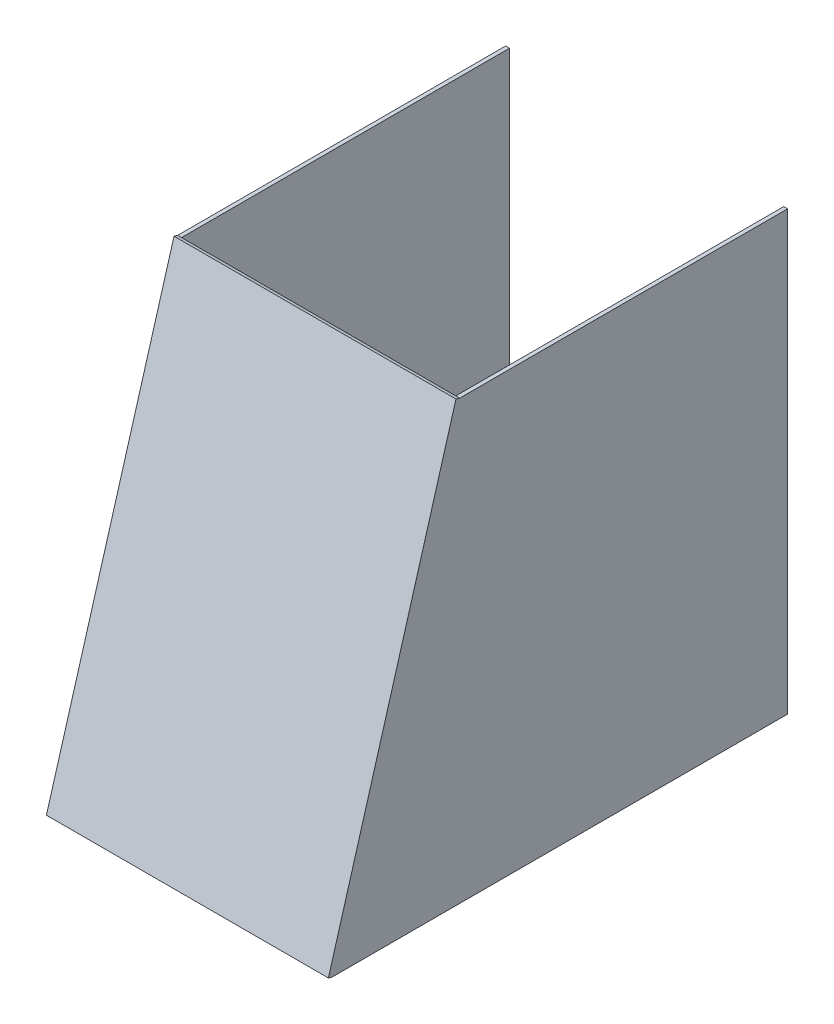
ISO-10303-21;
HEADER;
FILE_DESCRIPTION(('STEP AP214'),'2;1');
FILE_NAME('part.step','',(''),(''),'','','');
FILE_SCHEMA(('AUTOMOTIVE_DESIGN { 1 0 10303 214 1 1 1 1 }'));
ENDSEC;
DATA;
#1=APPLICATION_CONTEXT('core data for automotive mechanical design processes');
#2=APPLICATION_PROTOCOL_DEFINITION('international standard','automotive_design',2000,#1);
#3=PRODUCT_CONTEXT('',#1,'mechanical');
#4=PRODUCT('Part','Part','',(#3));
#5=PRODUCT_RELATED_PRODUCT_CATEGORY('part','',(#4));
#6=PRODUCT_DEFINITION_FORMATION('','',#4);
#7=PRODUCT_DEFINITION_CONTEXT('part definition',#1,'design');
#8=PRODUCT_DEFINITION('design','',#6,#7);
#9=PRODUCT_DEFINITION_SHAPE('','',#8);
#10=(LENGTH_UNIT() NAMED_UNIT(*) SI_UNIT(.MILLI.,.METRE.));
#11=(NAMED_UNIT(*) PLANE_ANGLE_UNIT() SI_UNIT($,.RADIAN.));
#12=(NAMED_UNIT(*) SI_UNIT($,.STERADIAN.) SOLID_ANGLE_UNIT());
#13=UNCERTAINTY_MEASURE_WITH_UNIT(LENGTH_MEASURE(1.E-05),#10,'distance_accuracy_value','');
#14=(GEOMETRIC_REPRESENTATION_CONTEXT(3) GLOBAL_UNCERTAINTY_ASSIGNED_CONTEXT((#13)) GLOBAL_UNIT_ASSIGNED_CONTEXT((#10,
#11,#12)) REPRESENTATION_CONTEXT('',''));
#15=CARTESIAN_POINT('',(0.,0.,0.));
#16=DIRECTION('',(0.,0.,1.));
#17=DIRECTION('',(1.,0.,0.));
#18=AXIS2_PLACEMENT_3D('',#15,#16,#17);
#19=CARTESIAN_POINT('',(0.,61.1869266504243,209.871158410955));
#20=DIRECTION('',(0.,-0.279892519517693,-0.960031341945688));
#21=DIRECTION('',(0.,0.960031341945688,-0.279892519517693));
#22=AXIS2_PLACEMENT_3D('',#19,#20,#21);
#23=PLANE('',#22);
#24=DIRECTION('',(1.,0.,0.));
#25=VECTOR('',#24,1.);
#26=CARTESIAN_POINT('',(110.5,-13.,231.5));
#27=LINE('',#26,#25);
#28=CARTESIAN_POINT('',(-107.5,-13.,231.5));
#29=VERTEX_POINT('',#28);
#30=CARTESIAN_POINT('',(107.5,-13.,231.5));
#31=VERTEX_POINT('',#30);
#32=EDGE_CURVE('E142',#29,#31,#27,.T.);
#33=ORIENTED_EDGE('',*,*,#32,.F.);
#34=DIRECTION('',(0.,-0.960031341945688,0.279892519517693));
#35=VECTOR('',#34,1.);
#36=CARTESIAN_POINT('',(-107.5,330.,131.5));
#37=LINE('',#36,#35);
#38=CARTESIAN_POINT('',(-107.5,330.,131.5));
#39=VERTEX_POINT('',#38);
#40=EDGE_CURVE('E150',#39,#29,#37,.T.);
#41=ORIENTED_EDGE('',*,*,#40,.F.);
#42=DIRECTION('',(-1.,0.,0.));
#43=VECTOR('',#42,1.);
#44=CARTESIAN_POINT('',(-110.5,330.,131.5));
#45=LINE('',#44,#43);
#46=CARTESIAN_POINT('',(107.5,330.,131.5));
#47=VERTEX_POINT('',#46);
#48=EDGE_CURVE('E165',#47,#39,#45,.T.);
#49=ORIENTED_EDGE('',*,*,#48,.F.);
#50=DIRECTION('',(0.,-0.960031341945688,0.279892519517693));
#51=VECTOR('',#50,1.);
#52=CARTESIAN_POINT('',(107.5,330.,131.5));
#53=LINE('',#52,#51);
#54=EDGE_CURVE('E194',#47,#31,#53,.T.);
#55=ORIENTED_EDGE('',*,*,#54,.T.);
#56=EDGE_LOOP('',(#33,#41,#49,#55));
#57=FACE_BOUND('',#56,.T.);
#58=ADVANCED_FACE('F37',(#57),#23,.T.);
#59=CARTESIAN_POINT('',(110.5,-13.,-125.5));
#60=DIRECTION('',(0.,0.,1.));
#61=DIRECTION('',(1.,0.,0.));
#62=AXIS2_PLACEMENT_3D('',#59,#60,#61);
#63=PLANE('',#62);
#64=DIRECTION('',(0.,1.,0.));
#65=VECTOR('',#64,1.);
#66=CARTESIAN_POINT('',(107.5,-13.,-125.5));
#67=LINE('',#66,#65);
#68=CARTESIAN_POINT('',(107.5,-13.,-125.5));
#69=VERTEX_POINT('',#68);
#70=CARTESIAN_POINT('',(107.5,330.,-125.5));
#71=VERTEX_POINT('',#70);
#72=EDGE_CURVE('E185',#69,#71,#67,.T.);
#73=ORIENTED_EDGE('',*,*,#72,.T.);
#74=DIRECTION('',(-1.,0.,0.));
#75=VECTOR('',#74,1.);
#76=CARTESIAN_POINT('',(110.5,330.,-125.5));
#77=LINE('',#76,#75);
#78=CARTESIAN_POINT('',(110.5,330.,-125.5));
#79=VERTEX_POINT('',#78);
#80=EDGE_CURVE('E11',#79,#71,#77,.T.);
#81=ORIENTED_EDGE('',*,*,#80,.F.);
#82=DIRECTION('',(0.,1.,0.));
#83=VECTOR('',#82,1.);
#84=CARTESIAN_POINT('',(110.5,-13.,-125.5));
#85=LINE('',#84,#83);
#86=CARTESIAN_POINT('',(110.5,-13.,-125.5));
#87=VERTEX_POINT('',#86);
#88=EDGE_CURVE('E186',#87,#79,#85,.T.);
#89=ORIENTED_EDGE('',*,*,#88,.F.);
#90=DIRECTION('',(-1.,0.,0.));
#91=VECTOR('',#90,1.);
#92=CARTESIAN_POINT('',(110.5,-13.,-125.5));
#93=LINE('',#92,#91);
#94=EDGE_CURVE('E190',#87,#69,#93,.T.);
#95=ORIENTED_EDGE('',*,*,#94,.T.);
#96=EDGE_LOOP('',(#73,#81,#89,#95));
#97=FACE_BOUND('',#96,.T.);
#98=ADVANCED_FACE('F39',(#97),#63,.F.);
#99=CARTESIAN_POINT('',(110.5,330.,-125.5));
#100=DIRECTION('',(0.,-1.,0.));
#101=DIRECTION('',(0.,0.,-1.));
#102=AXIS2_PLACEMENT_3D('',#99,#100,#101);
#103=PLANE('',#102);
#104=DIRECTION('',(0.,0.,1.));
#105=VECTOR('',#104,1.);
#106=CARTESIAN_POINT('',(107.5,330.,-125.5));
#107=LINE('',#106,#105);
#108=EDGE_CURVE('E67',#71,#47,#107,.T.);
#109=ORIENTED_EDGE('',*,*,#108,.T.);
#110=DIRECTION('',(-1.,0.,0.));
#111=VECTOR('',#110,1.);
#112=CARTESIAN_POINT('',(110.5,330.,131.5));
#113=LINE('',#112,#111);
#114=CARTESIAN_POINT('',(110.5,330.,131.5));
#115=VERTEX_POINT('',#114);
#116=EDGE_CURVE('E46',#115,#47,#113,.T.);
#117=ORIENTED_EDGE('',*,*,#116,.F.);
#118=DIRECTION('',(0.,0.,1.));
#119=VECTOR('',#118,1.);
#120=CARTESIAN_POINT('',(110.5,330.,-125.5));
#121=LINE('',#120,#119);
#122=EDGE_CURVE('E79',#79,#115,#121,.T.);
#123=ORIENTED_EDGE('',*,*,#122,.F.);
#124=ORIENTED_EDGE('',*,*,#80,.T.);
#125=EDGE_LOOP('',(#109,#117,#123,#124));
#126=FACE_BOUND('',#125,.T.);
#127=ADVANCED_FACE('F206',(#126),#103,.F.);
#128=CARTESIAN_POINT('',(110.5,-13.,231.5));
#129=DIRECTION('',(0.,1.,0.));
#130=DIRECTION('',(0.,0.,1.));
#131=AXIS2_PLACEMENT_3D('',#128,#129,#130);
#132=PLANE('',#131);
#133=DIRECTION('',(0.,0.,-1.));
#134=VECTOR('',#133,1.);
#135=CARTESIAN_POINT('',(107.5,-13.,231.5));
#136=LINE('',#135,#134);
#137=EDGE_CURVE('E74',#31,#69,#136,.T.);
#138=ORIENTED_EDGE('',*,*,#137,.T.);
#139=ORIENTED_EDGE('',*,*,#94,.F.);
#140=DIRECTION('',(0.,0.,-1.));
#141=VECTOR('',#140,1.);
#142=CARTESIAN_POINT('',(110.5,-13.,231.5));
#143=LINE('',#142,#141);
#144=CARTESIAN_POINT('',(110.5,-13.,231.5));
#145=VERTEX_POINT('',#144);
#146=EDGE_CURVE('E54',#145,#87,#143,.T.);
#147=ORIENTED_EDGE('',*,*,#146,.F.);
#148=DIRECTION('',(-1.,0.,0.));
#149=VECTOR('',#148,1.);
#150=CARTESIAN_POINT('',(110.5,-13.,231.5));
#151=LINE('',#150,#149);
#152=EDGE_CURVE('E199',#145,#31,#151,.T.);
#153=ORIENTED_EDGE('',*,*,#152,.T.);
#154=EDGE_LOOP('',(#138,#139,#147,#153));
#155=FACE_BOUND('',#154,.T.);
#156=ADVANCED_FACE('F208',(#155),#132,.F.);
#157=CARTESIAN_POINT('',(110.5,0.,0.));
#158=DIRECTION('',(1.,0.,0.));
#159=DIRECTION('',(0.,0.,-1.));
#160=AXIS2_PLACEMENT_3D('',#157,#158,#159);
#161=PLANE('',#160);
#162=ORIENTED_EDGE('',*,*,#88,.T.);
#163=ORIENTED_EDGE('',*,*,#122,.T.);
#164=DIRECTION('',(0.,-0.279892519517693,-0.960031341945688));
#165=VECTOR('',#164,1.);
#166=CARTESIAN_POINT('',(110.5,330.839677558553,134.380094025837));
#167=LINE('',#166,#165);
#168=CARTESIAN_POINT('',(110.5,330.839677558553,134.380094025837));
#169=VERTEX_POINT('',#168);
#170=EDGE_CURVE('E177',#169,#115,#167,.T.);
#171=ORIENTED_EDGE('',*,*,#170,.F.);
#172=DIRECTION('',(0.,0.960031341945688,-0.279892519517693));
#173=VECTOR('',#172,1.);
#174=CARTESIAN_POINT('',(110.5,330.839677558553,134.380094025837));
#175=LINE('',#174,#173);
#176=CARTESIAN_POINT('',(110.5,-12.1603224414469,234.380094025837));
#177=VERTEX_POINT('',#176);
#178=EDGE_CURVE('E167',#177,#169,#175,.T.);
#179=ORIENTED_EDGE('',*,*,#178,.F.);
#180=DIRECTION('',(0.,-0.279892519517693,-0.960031341945688));
#181=VECTOR('',#180,1.);
#182=CARTESIAN_POINT('',(110.5,-12.1603224414469,234.380094025837));
#183=LINE('',#182,#181);
#184=EDGE_CURVE('E180',#177,#145,#183,.T.);
#185=ORIENTED_EDGE('',*,*,#184,.T.);
#186=ORIENTED_EDGE('',*,*,#146,.T.);
#187=EDGE_LOOP('',(#162,#163,#171,#179,#185,#186));
#188=FACE_BOUND('',#187,.T.);
#189=ADVANCED_FACE('F213',(#188),#161,.T.);
#190=CARTESIAN_POINT('',(107.5,0.,0.));
#191=DIRECTION('',(1.,0.,0.));
#192=DIRECTION('',(0.,0.,-1.));
#193=AXIS2_PLACEMENT_3D('',#190,#191,#192);
#194=PLANE('',#193);
#195=ORIENTED_EDGE('',*,*,#72,.F.);
#196=ORIENTED_EDGE('',*,*,#137,.F.);
#197=ORIENTED_EDGE('',*,*,#54,.F.);
#198=ORIENTED_EDGE('',*,*,#108,.F.);
#199=EDGE_LOOP('',(#195,#196,#197,#198));
#200=FACE_BOUND('',#199,.T.);
#201=ADVANCED_FACE('F234',(#200),#194,.F.);
#202=CARTESIAN_POINT('',(-110.5,-12.1603224414469,234.380094025837));
#203=DIRECTION('',(1.,0.,0.));
#204=DIRECTION('',(0.,0.,-1.));
#205=AXIS2_PLACEMENT_3D('',#202,#203,#204);
#206=PLANE('',#205);
#207=DIRECTION('',(0.,-0.279892519517693,-0.960031341945688));
#208=VECTOR('',#207,1.);
#209=CARTESIAN_POINT('',(-110.5,330.839677558553,134.380094025837));
#210=LINE('',#209,#208);
#211=CARTESIAN_POINT('',(-110.5,330.839677558553,134.380094025837));
#212=VERTEX_POINT('',#211);
#213=CARTESIAN_POINT('',(-110.5,330.,131.5));
#214=VERTEX_POINT('',#213);
#215=EDGE_CURVE('E129',#212,#214,#210,.T.);
#216=ORIENTED_EDGE('',*,*,#215,.T.);
#217=DIRECTION('',(0.,0.,1.));
#218=VECTOR('',#217,1.);
#219=CARTESIAN_POINT('',(-110.5,330.,-125.5));
#220=LINE('',#219,#218);
#221=CARTESIAN_POINT('',(-110.5,330.,-125.5));
#222=VERTEX_POINT('',#221);
#223=EDGE_CURVE('E121',#222,#214,#220,.T.);
#224=ORIENTED_EDGE('',*,*,#223,.F.);
#225=DIRECTION('',(0.,1.,0.));
#226=VECTOR('',#225,1.);
#227=CARTESIAN_POINT('',(-110.5,-13.,-125.5));
#228=LINE('',#227,#226);
#229=CARTESIAN_POINT('',(-110.5,-13.,-125.5));
#230=VERTEX_POINT('',#229);
#231=EDGE_CURVE('E125',#230,#222,#228,.T.);
#232=ORIENTED_EDGE('',*,*,#231,.F.);
#233=DIRECTION('',(0.,0.,-1.));
#234=VECTOR('',#233,1.);
#235=CARTESIAN_POINT('',(-110.5,-13.,231.5));
#236=LINE('',#235,#234);
#237=CARTESIAN_POINT('',(-110.5,-13.,231.5));
#238=VERTEX_POINT('',#237);
#239=EDGE_CURVE('E132',#238,#230,#236,.T.);
#240=ORIENTED_EDGE('',*,*,#239,.F.);
#241=DIRECTION('',(0.,-0.279892519517693,-0.960031341945688));
#242=VECTOR('',#241,1.);
#243=CARTESIAN_POINT('',(-110.5,-12.1603224414469,234.380094025837));
#244=LINE('',#243,#242);
#245=CARTESIAN_POINT('',(-110.5,-12.1603224414469,234.380094025837));
#246=VERTEX_POINT('',#245);
#247=EDGE_CURVE('E182',#246,#238,#244,.T.);
#248=ORIENTED_EDGE('',*,*,#247,.F.);
#249=DIRECTION('',(0.,-0.960031341945688,0.279892519517693));
#250=VECTOR('',#249,1.);
#251=CARTESIAN_POINT('',(-110.5,-12.1603224414469,234.380094025837));
#252=LINE('',#251,#250);
#253=EDGE_CURVE('E161',#212,#246,#252,.T.);
#254=ORIENTED_EDGE('',*,*,#253,.F.);
#255=EDGE_LOOP('',(#216,#224,#232,#240,#248,#254));
#256=FACE_BOUND('',#255,.T.);
#257=ADVANCED_FACE('F123',(#256),#206,.F.);
#258=CARTESIAN_POINT('',(110.5,-12.1603224414469,234.380094025837));
#259=DIRECTION('',(0.,0.960031341945688,-0.279892519517693));
#260=DIRECTION('',(0.,0.279892519517693,0.960031341945688));
#261=AXIS2_PLACEMENT_3D('',#258,#259,#260);
#262=PLANE('',#261);
#263=EDGE_CURVE('E171',#238,#29,#27,.T.);
#264=ORIENTED_EDGE('',*,*,#263,.T.);
#265=ORIENTED_EDGE('',*,*,#32,.T.);
#266=ORIENTED_EDGE('',*,*,#152,.F.);
#267=ORIENTED_EDGE('',*,*,#184,.F.);
#268=DIRECTION('',(1.,0.,0.));
#269=VECTOR('',#268,1.);
#270=CARTESIAN_POINT('',(110.5,-12.1603224414469,234.380094025837));
#271=LINE('',#270,#269);
#272=EDGE_CURVE('E164',#246,#177,#271,.T.);
#273=ORIENTED_EDGE('',*,*,#272,.F.);
#274=ORIENTED_EDGE('',*,*,#247,.T.);
#275=EDGE_LOOP('',(#264,#265,#266,#267,#273,#274));
#276=FACE_BOUND('',#275,.T.);
#277=ADVANCED_FACE('F228',(#276),#262,.F.);
#278=CARTESIAN_POINT('',(-110.5,330.839677558553,134.380094025837));
#279=DIRECTION('',(0.,-0.960031341945688,0.279892519517693));
#280=DIRECTION('',(0.,-0.279892519517693,-0.960031341945688));
#281=AXIS2_PLACEMENT_3D('',#278,#279,#280);
#282=PLANE('',#281);
#283=ORIENTED_EDGE('',*,*,#116,.T.);
#284=ORIENTED_EDGE('',*,*,#48,.T.);
#285=DIRECTION('',(1.,0.,0.));
#286=VECTOR('',#285,1.);
#287=CARTESIAN_POINT('',(-110.5,330.,131.5));
#288=LINE('',#287,#286);
#289=EDGE_CURVE('E143',#214,#39,#288,.T.);
#290=ORIENTED_EDGE('',*,*,#289,.F.);
#291=ORIENTED_EDGE('',*,*,#215,.F.);
#292=DIRECTION('',(-1.,0.,0.));
#293=VECTOR('',#292,1.);
#294=CARTESIAN_POINT('',(-110.5,330.839677558553,134.380094025837));
#295=LINE('',#294,#293);
#296=EDGE_CURVE('E169',#169,#212,#295,.T.);
#297=ORIENTED_EDGE('',*,*,#296,.F.);
#298=ORIENTED_EDGE('',*,*,#170,.T.);
#299=EDGE_LOOP('',(#283,#284,#290,#291,#297,#298));
#300=FACE_BOUND('',#299,.T.);
#301=ADVANCED_FACE('F202',(#300),#282,.F.);
#302=CARTESIAN_POINT('',(0.,62.0266042089774,212.751252436792));
#303=DIRECTION('',(0.,-0.279892519517693,-0.960031341945688));
#304=DIRECTION('',(0.,0.960031341945688,-0.279892519517693));
#305=AXIS2_PLACEMENT_3D('',#302,#303,#304);
#306=PLANE('',#305);
#307=ORIENTED_EDGE('',*,*,#253,.T.);
#308=ORIENTED_EDGE('',*,*,#272,.T.);
#309=ORIENTED_EDGE('',*,*,#178,.T.);
#310=ORIENTED_EDGE('',*,*,#296,.T.);
#311=EDGE_LOOP('',(#307,#308,#309,#310));
#312=FACE_BOUND('',#311,.T.);
#313=ADVANCED_FACE('F224',(#312),#306,.F.);
#314=CARTESIAN_POINT('',(-110.5,-13.,-125.5));
#315=DIRECTION('',(0.,0.,1.));
#316=DIRECTION('',(-1.,0.,0.));
#317=AXIS2_PLACEMENT_3D('',#314,#315,#316);
#318=PLANE('',#317);
#319=DIRECTION('',(0.,1.,0.));
#320=VECTOR('',#319,1.);
#321=CARTESIAN_POINT('',(-107.5,-13.,-125.5));
#322=LINE('',#321,#320);
#323=CARTESIAN_POINT('',(-107.5,-13.,-125.5));
#324=VERTEX_POINT('',#323);
#325=CARTESIAN_POINT('',(-107.5,330.,-125.5));
#326=VERTEX_POINT('',#325);
#327=EDGE_CURVE('E154',#324,#326,#322,.T.);
#328=ORIENTED_EDGE('',*,*,#327,.F.);
#329=DIRECTION('',(1.,0.,0.));
#330=VECTOR('',#329,1.);
#331=CARTESIAN_POINT('',(-110.5,-13.,-125.5));
#332=LINE('',#331,#330);
#333=EDGE_CURVE('E147',#230,#324,#332,.T.);
#334=ORIENTED_EDGE('',*,*,#333,.F.);
#335=ORIENTED_EDGE('',*,*,#231,.T.);
#336=DIRECTION('',(1.,0.,0.));
#337=VECTOR('',#336,1.);
#338=CARTESIAN_POINT('',(-110.5,330.,-125.5));
#339=LINE('',#338,#337);
#340=EDGE_CURVE('E135',#222,#326,#339,.T.);
#341=ORIENTED_EDGE('',*,*,#340,.T.);
#342=EDGE_LOOP('',(#328,#334,#335,#341));
#343=FACE_BOUND('',#342,.T.);
#344=ADVANCED_FACE('F145',(#343),#318,.F.);
#345=CARTESIAN_POINT('',(-110.5,330.,-125.5));
#346=DIRECTION('',(0.,-1.,0.));
#347=DIRECTION('',(0.,0.,-1.));
#348=AXIS2_PLACEMENT_3D('',#345,#346,#347);
#349=PLANE('',#348);
#350=DIRECTION('',(0.,0.,1.));
#351=VECTOR('',#350,1.);
#352=CARTESIAN_POINT('',(-107.5,330.,-125.5));
#353=LINE('',#352,#351);
#354=EDGE_CURVE('E138',#326,#39,#353,.T.);
#355=ORIENTED_EDGE('',*,*,#354,.F.);
#356=ORIENTED_EDGE('',*,*,#340,.F.);
#357=ORIENTED_EDGE('',*,*,#223,.T.);
#358=ORIENTED_EDGE('',*,*,#289,.T.);
#359=EDGE_LOOP('',(#355,#356,#357,#358));
#360=FACE_BOUND('',#359,.T.);
#361=ADVANCED_FACE('F136',(#360),#349,.F.);
#362=CARTESIAN_POINT('',(-110.5,-13.,231.5));
#363=DIRECTION('',(0.,1.,0.));
#364=DIRECTION('',(0.,0.,1.));
#365=AXIS2_PLACEMENT_3D('',#362,#363,#364);
#366=PLANE('',#365);
#367=DIRECTION('',(0.,0.,-1.));
#368=VECTOR('',#367,1.);
#369=CARTESIAN_POINT('',(-107.5,-13.,231.5));
#370=LINE('',#369,#368);
#371=EDGE_CURVE('E148',#29,#324,#370,.T.);
#372=ORIENTED_EDGE('',*,*,#371,.F.);
#373=ORIENTED_EDGE('',*,*,#263,.F.);
#374=ORIENTED_EDGE('',*,*,#239,.T.);
#375=ORIENTED_EDGE('',*,*,#333,.T.);
#376=EDGE_LOOP('',(#372,#373,#374,#375));
#377=FACE_BOUND('',#376,.T.);
#378=ADVANCED_FACE('F251',(#377),#366,.F.);
#379=CARTESIAN_POINT('',(-107.5,0.,0.));
#380=DIRECTION('',(-1.,0.,0.));
#381=DIRECTION('',(0.,0.,-1.));
#382=AXIS2_PLACEMENT_3D('',#379,#380,#381);
#383=PLANE('',#382);
#384=ORIENTED_EDGE('',*,*,#327,.T.);
#385=ORIENTED_EDGE('',*,*,#354,.T.);
#386=ORIENTED_EDGE('',*,*,#40,.T.);
#387=ORIENTED_EDGE('',*,*,#371,.T.);
#388=EDGE_LOOP('',(#384,#385,#386,#387));
#389=FACE_BOUND('',#388,.T.);
#390=ADVANCED_FACE('F254',(#389),#383,.F.);
#391=CLOSED_SHELL('',(#58,#98,#127,#156,#189,#201,#257,#277,#301,#313,#344,#361,#378,#390));
#392=MANIFOLD_SOLID_BREP('B2',#391);
#393=ADVANCED_BREP_SHAPE_REPRESENTATION('',(#18,#392),#14);
#394=SHAPE_DEFINITION_REPRESENTATION(#9,#393);
ENDSEC;
END-ISO-10303-21;
